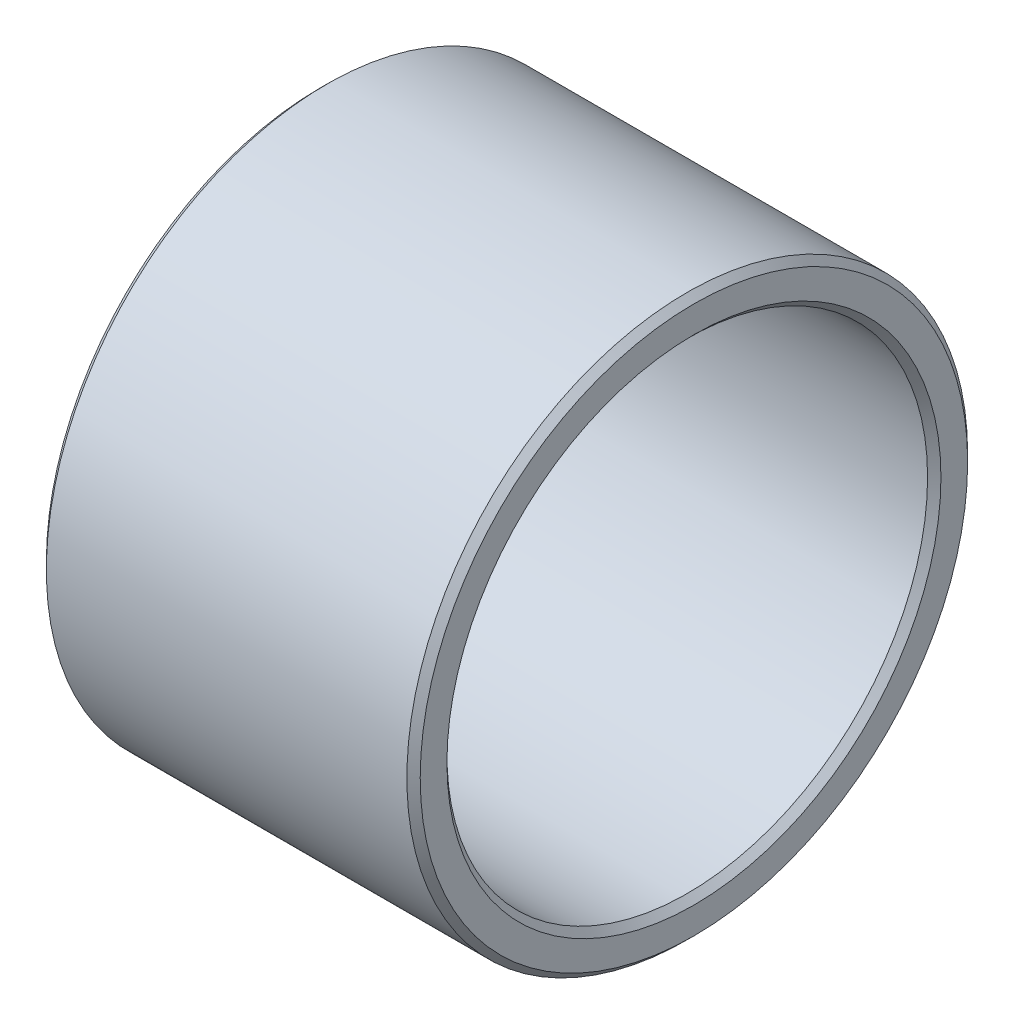
ISO-10303-21;
HEADER;
FILE_DESCRIPTION(('STEP AP214'),'2;1');
FILE_NAME('part.step','',(''),(''),'','','');
FILE_SCHEMA(('AUTOMOTIVE_DESIGN { 1 0 10303 214 1 1 1 1 }'));
ENDSEC;
DATA;
#1=APPLICATION_CONTEXT('core data for automotive mechanical design processes');
#2=APPLICATION_PROTOCOL_DEFINITION('international standard','automotive_design',2000,#1);
#3=PRODUCT_CONTEXT('',#1,'mechanical');
#4=PRODUCT('Part','Part','',(#3));
#5=PRODUCT_RELATED_PRODUCT_CATEGORY('part','',(#4));
#6=PRODUCT_DEFINITION_FORMATION('','',#4);
#7=PRODUCT_DEFINITION_CONTEXT('part definition',#1,'design');
#8=PRODUCT_DEFINITION('design','',#6,#7);
#9=PRODUCT_DEFINITION_SHAPE('','',#8);
#10=(LENGTH_UNIT() NAMED_UNIT(*) SI_UNIT(.MILLI.,.METRE.));
#11=(NAMED_UNIT(*) PLANE_ANGLE_UNIT() SI_UNIT($,.RADIAN.));
#12=(NAMED_UNIT(*) SI_UNIT($,.STERADIAN.) SOLID_ANGLE_UNIT());
#13=UNCERTAINTY_MEASURE_WITH_UNIT(LENGTH_MEASURE(1.E-05),#10,'distance_accuracy_value','');
#14=(GEOMETRIC_REPRESENTATION_CONTEXT(3) GLOBAL_UNCERTAINTY_ASSIGNED_CONTEXT((#13)) GLOBAL_UNIT_ASSIGNED_CONTEXT((#10,
#11,#12)) REPRESENTATION_CONTEXT('',''));
#15=CARTESIAN_POINT('',(0.,0.,0.));
#16=DIRECTION('',(0.,0.,1.));
#17=DIRECTION('',(1.,0.,0.));
#18=AXIS2_PLACEMENT_3D('',#15,#16,#17);
#19=CARTESIAN_POINT('',(28.,0.,0.));
#20=DIRECTION('',(1.,0.,0.));
#21=DIRECTION('',(0.,0.,-1.));
#22=AXIS2_PLACEMENT_3D('',#19,#20,#21);
#23=PLANE('',#22);
#24=CARTESIAN_POINT('',(28.,0.,0.));
#25=DIRECTION('',(1.,0.,0.));
#26=DIRECTION('',(0.,0.,-1.));
#27=AXIS2_PLACEMENT_3D('',#24,#25,#26);
#28=CIRCLE('',#27,18.5);
#29=CARTESIAN_POINT('',(28.,0.,-18.5));
#30=VERTEX_POINT('',#29);
#31=EDGE_CURVE('E10',#30,#30,#28,.F.);
#32=ORIENTED_EDGE('',*,*,#31,.T.);
#33=EDGE_LOOP('',(#32));
#34=FACE_BOUND('',#33,.T.);
#35=CARTESIAN_POINT('',(28.,0.,0.));
#36=DIRECTION('',(1.,0.,0.));
#37=DIRECTION('',(0.,0.,-1.));
#38=AXIS2_PLACEMENT_3D('',#35,#36,#37);
#39=CIRCLE('',#38,20.5);
#40=CARTESIAN_POINT('',(28.,0.,-20.5));
#41=VERTEX_POINT('',#40);
#42=EDGE_CURVE('E39',#41,#41,#39,.T.);
#43=ORIENTED_EDGE('',*,*,#42,.T.);
#44=EDGE_LOOP('',(#43));
#45=FACE_BOUND('',#44,.T.);
#46=ADVANCED_FACE('F32',(#34,#45),#23,.T.);
#47=CARTESIAN_POINT('',(0.,0.,0.));
#48=DIRECTION('',(1.,0.,0.));
#49=DIRECTION('',(0.,0.,-1.));
#50=AXIS2_PLACEMENT_3D('',#47,#48,#49);
#51=PLANE('',#50);
#52=CARTESIAN_POINT('',(0.,0.,0.));
#53=DIRECTION('',(1.,0.,0.));
#54=DIRECTION('',(0.,0.,-1.));
#55=AXIS2_PLACEMENT_3D('',#52,#53,#54);
#56=CIRCLE('',#55,18.5);
#57=CARTESIAN_POINT('',(0.,0.,-18.5));
#58=VERTEX_POINT('',#57);
#59=EDGE_CURVE('E58',#58,#58,#56,.T.);
#60=ORIENTED_EDGE('',*,*,#59,.T.);
#61=EDGE_LOOP('',(#60));
#62=FACE_BOUND('',#61,.T.);
#63=CARTESIAN_POINT('',(0.,0.,0.));
#64=DIRECTION('',(1.,0.,0.));
#65=DIRECTION('',(0.,0.,-1.));
#66=AXIS2_PLACEMENT_3D('',#63,#64,#65);
#67=CIRCLE('',#66,20.5);
#68=CARTESIAN_POINT('',(0.,0.,-20.5));
#69=VERTEX_POINT('',#68);
#70=EDGE_CURVE('E61',#69,#69,#67,.F.);
#71=ORIENTED_EDGE('',*,*,#70,.T.);
#72=EDGE_LOOP('',(#71));
#73=FACE_BOUND('',#72,.T.);
#74=ADVANCED_FACE('F65',(#62,#73),#51,.F.);
#75=CARTESIAN_POINT('',(28.,0.,0.));
#76=DIRECTION('',(-1.,0.,0.));
#77=DIRECTION('',(0.,0.,1.));
#78=AXIS2_PLACEMENT_3D('',#75,#76,#77);
#79=CYLINDRICAL_SURFACE('',#78,21.);
#80=CARTESIAN_POINT('',(0.49999999999999,0.,0.));
#81=DIRECTION('',(1.,0.,0.));
#82=DIRECTION('',(0.,0.,-1.));
#83=AXIS2_PLACEMENT_3D('',#80,#81,#82);
#84=CIRCLE('',#83,21.);
#85=CARTESIAN_POINT('',(0.49999999999999,0.,-21.));
#86=VERTEX_POINT('',#85);
#87=EDGE_CURVE('E43',#86,#86,#84,.T.);
#88=ORIENTED_EDGE('',*,*,#87,.T.);
#89=EDGE_LOOP('',(#88));
#90=FACE_BOUND('',#89,.T.);
#91=CARTESIAN_POINT('',(27.5,0.,0.));
#92=DIRECTION('',(1.,0.,0.));
#93=DIRECTION('',(0.,0.,-1.));
#94=AXIS2_PLACEMENT_3D('',#91,#92,#93);
#95=CIRCLE('',#94,21.);
#96=CARTESIAN_POINT('',(27.5,0.,-21.));
#97=VERTEX_POINT('',#96);
#98=EDGE_CURVE('E47',#97,#97,#95,.F.);
#99=ORIENTED_EDGE('',*,*,#98,.T.);
#100=EDGE_LOOP('',(#99));
#101=FACE_BOUND('',#100,.T.);
#102=ADVANCED_FACE('F75',(#90,#101),#79,.T.);
#103=CARTESIAN_POINT('',(28.,0.,0.));
#104=DIRECTION('',(-1.,0.,0.));
#105=DIRECTION('',(0.,0.,1.));
#106=AXIS2_PLACEMENT_3D('',#103,#104,#105);
#107=CYLINDRICAL_SURFACE('',#106,18.);
#108=CARTESIAN_POINT('',(0.500000000000004,0.,0.));
#109=DIRECTION('',(1.,0.,0.));
#110=DIRECTION('',(0.,0.,-1.));
#111=AXIS2_PLACEMENT_3D('',#108,#109,#110);
#112=CIRCLE('',#111,18.);
#113=CARTESIAN_POINT('',(0.500000000000004,0.,-18.));
#114=VERTEX_POINT('',#113);
#115=EDGE_CURVE('E52',#114,#114,#112,.F.);
#116=ORIENTED_EDGE('',*,*,#115,.T.);
#117=EDGE_LOOP('',(#116));
#118=FACE_BOUND('',#117,.T.);
#119=CARTESIAN_POINT('',(27.5,0.,0.));
#120=DIRECTION('',(1.,0.,0.));
#121=DIRECTION('',(0.,0.,-1.));
#122=AXIS2_PLACEMENT_3D('',#119,#120,#121);
#123=CIRCLE('',#122,18.);
#124=CARTESIAN_POINT('',(27.5,0.,-18.));
#125=VERTEX_POINT('',#124);
#126=EDGE_CURVE('E55',#125,#125,#123,.T.);
#127=ORIENTED_EDGE('',*,*,#126,.T.);
#128=EDGE_LOOP('',(#127));
#129=FACE_BOUND('',#128,.T.);
#130=ADVANCED_FACE('F78',(#118,#129),#107,.F.);
#131=CARTESIAN_POINT('',(0.,0.,0.));
#132=DIRECTION('',(-1.,0.,0.));
#133=DIRECTION('',(0.,0.,1.));
#134=AXIS2_PLACEMENT_3D('',#131,#132,#133);
#135=CONICAL_SURFACE('',#134,18.5,0.785398163397445);
#136=ORIENTED_EDGE('',*,*,#115,.F.);
#137=EDGE_LOOP('',(#136));
#138=FACE_BOUND('',#137,.T.);
#139=ORIENTED_EDGE('',*,*,#59,.F.);
#140=EDGE_LOOP('',(#139));
#141=FACE_BOUND('',#140,.T.);
#142=ADVANCED_FACE('F71',(#138,#141),#135,.F.);
#143=CARTESIAN_POINT('',(0.49999999999999,0.,0.));
#144=DIRECTION('',(1.,0.,0.));
#145=DIRECTION('',(0.,0.,-1.));
#146=AXIS2_PLACEMENT_3D('',#143,#144,#145);
#147=CONICAL_SURFACE('',#146,21.,0.785398163397448);
#148=ORIENTED_EDGE('',*,*,#70,.F.);
#149=EDGE_LOOP('',(#148));
#150=FACE_BOUND('',#149,.T.);
#151=ORIENTED_EDGE('',*,*,#87,.F.);
#152=EDGE_LOOP('',(#151));
#153=FACE_BOUND('',#152,.T.);
#154=ADVANCED_FACE('F67',(#150,#153),#147,.T.);
#155=CARTESIAN_POINT('',(27.5,0.,0.));
#156=DIRECTION('',(1.,0.,0.));
#157=DIRECTION('',(0.,0.,-1.));
#158=AXIS2_PLACEMENT_3D('',#155,#156,#157);
#159=CONICAL_SURFACE('',#158,18.,0.785398163397462);
#160=ORIENTED_EDGE('',*,*,#31,.F.);
#161=EDGE_LOOP('',(#160));
#162=FACE_BOUND('',#161,.T.);
#163=ORIENTED_EDGE('',*,*,#126,.F.);
#164=EDGE_LOOP('',(#163));
#165=FACE_BOUND('',#164,.T.);
#166=ADVANCED_FACE('F70',(#162,#165),#159,.F.);
#167=CARTESIAN_POINT('',(28.,0.,0.));
#168=DIRECTION('',(-1.,0.,0.));
#169=DIRECTION('',(0.,0.,1.));
#170=AXIS2_PLACEMENT_3D('',#167,#168,#169);
#171=CONICAL_SURFACE('',#170,20.5,0.785398163397434);
#172=ORIENTED_EDGE('',*,*,#98,.F.);
#173=EDGE_LOOP('',(#172));
#174=FACE_BOUND('',#173,.T.);
#175=ORIENTED_EDGE('',*,*,#42,.F.);
#176=EDGE_LOOP('',(#175));
#177=FACE_BOUND('',#176,.T.);
#178=ADVANCED_FACE('F34',(#174,#177),#171,.T.);
#179=CLOSED_SHELL('',(#46,#74,#102,#130,#142,#154,#166,#178));
#180=MANIFOLD_SOLID_BREP('B2',#179);
#181=ADVANCED_BREP_SHAPE_REPRESENTATION('',(#18,#180),#14);
#182=SHAPE_DEFINITION_REPRESENTATION(#9,#181);
ENDSEC;
END-ISO-10303-21;
